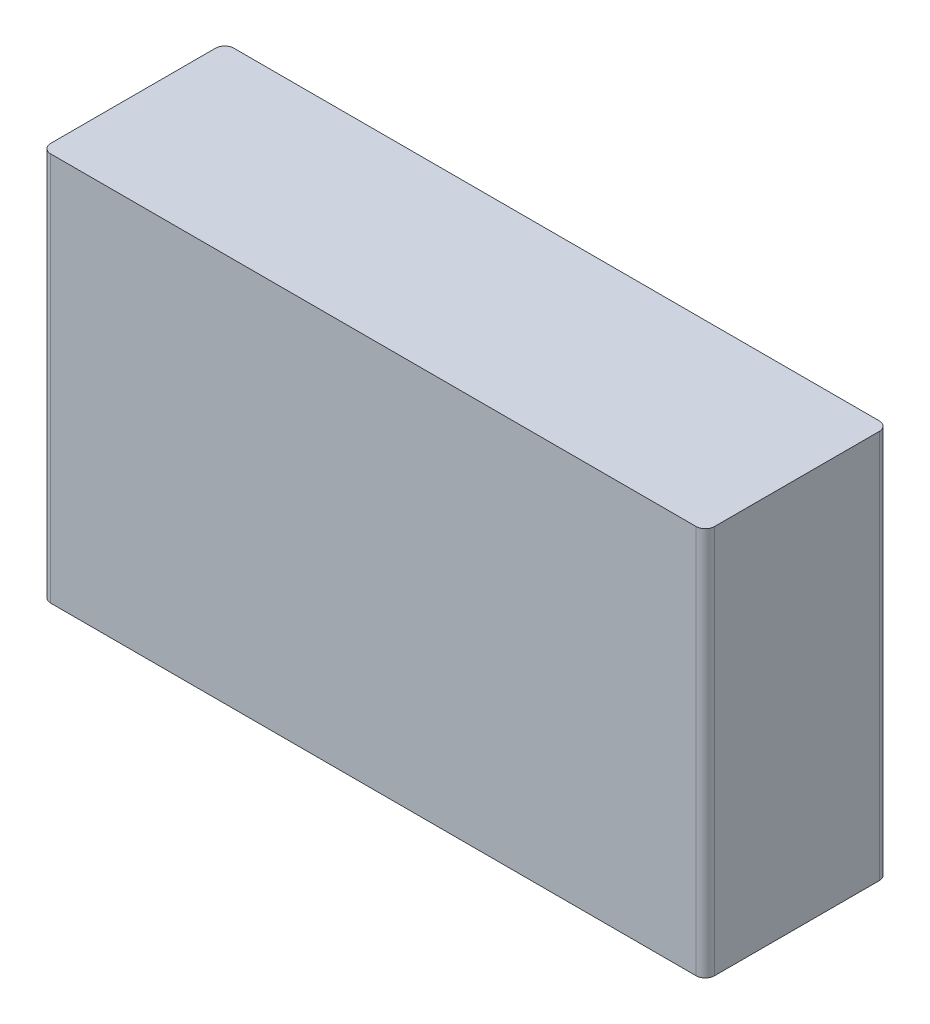
ISO-10303-21;
HEADER;
FILE_DESCRIPTION(('STEP AP214'),'2;1');
FILE_NAME('part.step','',(''),(''),'','','');
FILE_SCHEMA(('AUTOMOTIVE_DESIGN { 1 0 10303 214 1 1 1 1 }'));
ENDSEC;
DATA;
#1=APPLICATION_CONTEXT('core data for automotive mechanical design processes');
#2=APPLICATION_PROTOCOL_DEFINITION('international standard','automotive_design',2000,#1);
#3=PRODUCT_CONTEXT('',#1,'mechanical');
#4=PRODUCT('Part','Part','',(#3));
#5=PRODUCT_RELATED_PRODUCT_CATEGORY('part','',(#4));
#6=PRODUCT_DEFINITION_FORMATION('','',#4);
#7=PRODUCT_DEFINITION_CONTEXT('part definition',#1,'design');
#8=PRODUCT_DEFINITION('design','',#6,#7);
#9=PRODUCT_DEFINITION_SHAPE('','',#8);
#10=(LENGTH_UNIT() NAMED_UNIT(*) SI_UNIT(.MILLI.,.METRE.));
#11=(NAMED_UNIT(*) PLANE_ANGLE_UNIT() SI_UNIT($,.RADIAN.));
#12=(NAMED_UNIT(*) SI_UNIT($,.STERADIAN.) SOLID_ANGLE_UNIT());
#13=UNCERTAINTY_MEASURE_WITH_UNIT(LENGTH_MEASURE(1.E-05),#10,'distance_accuracy_value','');
#14=(GEOMETRIC_REPRESENTATION_CONTEXT(3) GLOBAL_UNCERTAINTY_ASSIGNED_CONTEXT((#13)) GLOBAL_UNIT_ASSIGNED_CONTEXT((#10,
#11,#12)) REPRESENTATION_CONTEXT('',''));
#15=CARTESIAN_POINT('',(0.,0.,0.));
#16=DIRECTION('',(0.,0.,1.));
#17=DIRECTION('',(1.,0.,0.));
#18=AXIS2_PLACEMENT_3D('',#15,#16,#17);
#19=CARTESIAN_POINT('',(0.775,0.425,0.));
#20=DIRECTION('',(0.,1.,0.));
#21=DIRECTION('',(1.,0.,0.));
#22=AXIS2_PLACEMENT_3D('',#19,#20,#21);
#23=PLANE('',#22);
#24=DIRECTION('',(1.,0.,0.));
#25=VECTOR('',#24,1.);
#26=CARTESIAN_POINT('',(0.75,0.425,0.05));
#27=LINE('',#26,#25);
#28=CARTESIAN_POINT('',(-0.705,0.425,0.05));
#29=VERTEX_POINT('',#28);
#30=CARTESIAN_POINT('',(0.705,0.425,0.05));
#31=VERTEX_POINT('',#30);
#32=EDGE_CURVE('E41',#29,#31,#27,.T.);
#33=ORIENTED_EDGE('',*,*,#32,.F.);
#34=CARTESIAN_POINT('',(-0.705,0.425,0.07));
#35=DIRECTION('',(0.,-1.,0.));
#36=DIRECTION('',(-0.707106781186548,0.,-0.707106781186548));
#37=AXIS2_PLACEMENT_3D('',#34,#35,#36);
#38=CIRCLE('',#37,0.02);
#39=CARTESIAN_POINT('',(-0.725,0.425,0.07));
#40=VERTEX_POINT('',#39);
#41=EDGE_CURVE('E165',#40,#29,#38,.T.);
#42=ORIENTED_EDGE('',*,*,#41,.F.);
#43=DIRECTION('',(0.,0.,-1.));
#44=VECTOR('',#43,1.);
#45=CARTESIAN_POINT('',(-0.725,0.425,0.025));
#46=LINE('',#45,#44);
#47=CARTESIAN_POINT('',(-0.725,0.425,0.43));
#48=VERTEX_POINT('',#47);
#49=EDGE_CURVE('E148',#48,#40,#46,.T.);
#50=ORIENTED_EDGE('',*,*,#49,.F.);
#51=CARTESIAN_POINT('',(-0.705,0.425,0.43));
#52=DIRECTION('',(0.,-1.,0.));
#53=DIRECTION('',(-0.707106781186548,0.,0.707106781186548));
#54=AXIS2_PLACEMENT_3D('',#51,#52,#53);
#55=CIRCLE('',#54,0.02);
#56=CARTESIAN_POINT('',(-0.705,0.425,0.45));
#57=VERTEX_POINT('',#56);
#58=EDGE_CURVE('E11',#57,#48,#55,.T.);
#59=ORIENTED_EDGE('',*,*,#58,.F.);
#60=DIRECTION('',(-1.,0.,0.));
#61=VECTOR('',#60,1.);
#62=CARTESIAN_POINT('',(0.025,0.425,0.45));
#63=LINE('',#62,#61);
#64=CARTESIAN_POINT('',(0.705,0.425,0.45));
#65=VERTEX_POINT('',#64);
#66=EDGE_CURVE('E144',#65,#57,#63,.T.);
#67=ORIENTED_EDGE('',*,*,#66,.F.);
#68=CARTESIAN_POINT('',(0.705,0.425,0.43));
#69=DIRECTION('',(0.,-1.,0.));
#70=DIRECTION('',(0.707106781186548,0.,0.707106781186548));
#71=AXIS2_PLACEMENT_3D('',#68,#69,#70);
#72=CIRCLE('',#71,0.02);
#73=CARTESIAN_POINT('',(0.725,0.425,0.43));
#74=VERTEX_POINT('',#73);
#75=EDGE_CURVE('E111',#74,#65,#72,.T.);
#76=ORIENTED_EDGE('',*,*,#75,.F.);
#77=DIRECTION('',(0.,0.,1.));
#78=VECTOR('',#77,1.);
#79=CARTESIAN_POINT('',(0.725,0.425,0.225));
#80=LINE('',#79,#78);
#81=CARTESIAN_POINT('',(0.725,0.425,0.07));
#82=VERTEX_POINT('',#81);
#83=EDGE_CURVE('E106',#82,#74,#80,.T.);
#84=ORIENTED_EDGE('',*,*,#83,.F.);
#85=CARTESIAN_POINT('',(0.705,0.425,0.07));
#86=DIRECTION('',(0.,-1.,0.));
#87=DIRECTION('',(0.707106781186548,0.,-0.707106781186548));
#88=AXIS2_PLACEMENT_3D('',#85,#86,#87);
#89=CIRCLE('',#88,0.02);
#90=EDGE_CURVE('E108',#31,#82,#89,.T.);
#91=ORIENTED_EDGE('',*,*,#90,.F.);
#92=EDGE_LOOP('',(#33,#42,#50,#59,#67,#76,#84,#91));
#93=FACE_BOUND('',#92,.T.);
#94=ADVANCED_FACE('F16',(#93),#23,.T.);
#95=CARTESIAN_POINT('',(-0.705,0.425,0.43));
#96=DIRECTION('',(0.,1.,0.));
#97=DIRECTION('',(-0.707106781186548,0.,0.707106781186548));
#98=AXIS2_PLACEMENT_3D('',#95,#96,#97);
#99=CYLINDRICAL_SURFACE('',#98,0.02);
#100=ORIENTED_EDGE('',*,*,#58,.T.);
#101=DIRECTION('',(0.,-1.,0.));
#102=VECTOR('',#101,1.);
#103=CARTESIAN_POINT('',(-0.725,0.425,0.43));
#104=LINE('',#103,#102);
#105=CARTESIAN_POINT('',(-0.725,-0.425,0.43));
#106=VERTEX_POINT('',#105);
#107=EDGE_CURVE('E27',#48,#106,#104,.T.);
#108=ORIENTED_EDGE('',*,*,#107,.T.);
#109=CARTESIAN_POINT('',(-0.705,-0.425,0.43));
#110=DIRECTION('',(0.,1.,0.));
#111=DIRECTION('',(-0.707106781186548,0.,0.707106781186548));
#112=AXIS2_PLACEMENT_3D('',#109,#110,#111);
#113=CIRCLE('',#112,0.02);
#114=CARTESIAN_POINT('',(-0.705,-0.425,0.45));
#115=VERTEX_POINT('',#114);
#116=EDGE_CURVE('E85',#106,#115,#113,.T.);
#117=ORIENTED_EDGE('',*,*,#116,.T.);
#118=DIRECTION('',(0.,1.,0.));
#119=VECTOR('',#118,1.);
#120=CARTESIAN_POINT('',(-0.705,0.425,0.45));
#121=LINE('',#120,#119);
#122=EDGE_CURVE('E75',#115,#57,#121,.T.);
#123=ORIENTED_EDGE('',*,*,#122,.T.);
#124=EDGE_LOOP('',(#100,#108,#117,#123));
#125=FACE_BOUND('',#124,.T.);
#126=ADVANCED_FACE('F214',(#125),#99,.T.);
#127=CARTESIAN_POINT('',(-0.775,-0.425,0.));
#128=DIRECTION('',(0.,-1.,0.));
#129=DIRECTION('',(0.,0.,-1.));
#130=AXIS2_PLACEMENT_3D('',#127,#128,#129);
#131=PLANE('',#130);
#132=DIRECTION('',(-1.,0.,0.));
#133=VECTOR('',#132,1.);
#134=CARTESIAN_POINT('',(-0.025,-0.425,0.05));
#135=LINE('',#134,#133);
#136=CARTESIAN_POINT('',(0.705,-0.425,0.05));
#137=VERTEX_POINT('',#136);
#138=CARTESIAN_POINT('',(-0.705,-0.425,0.05));
#139=VERTEX_POINT('',#138);
#140=EDGE_CURVE('E137',#137,#139,#135,.T.);
#141=ORIENTED_EDGE('',*,*,#140,.F.);
#142=CARTESIAN_POINT('',(0.705,-0.425,0.07));
#143=DIRECTION('',(0.,1.,0.));
#144=DIRECTION('',(0.707106781186548,0.,-0.707106781186548));
#145=AXIS2_PLACEMENT_3D('',#142,#143,#144);
#146=CIRCLE('',#145,0.02);
#147=CARTESIAN_POINT('',(0.725,-0.425,0.07));
#148=VERTEX_POINT('',#147);
#149=EDGE_CURVE('E149',#148,#137,#146,.T.);
#150=ORIENTED_EDGE('',*,*,#149,.F.);
#151=DIRECTION('',(0.,0.,-1.));
#152=VECTOR('',#151,1.);
#153=CARTESIAN_POINT('',(0.725,-0.425,0.225));
#154=LINE('',#153,#152);
#155=CARTESIAN_POINT('',(0.725,-0.425,0.43));
#156=VERTEX_POINT('',#155);
#157=EDGE_CURVE('E118',#156,#148,#154,.T.);
#158=ORIENTED_EDGE('',*,*,#157,.F.);
#159=CARTESIAN_POINT('',(0.705,-0.425,0.43));
#160=DIRECTION('',(0.,1.,0.));
#161=DIRECTION('',(0.707106781186548,0.,0.707106781186548));
#162=AXIS2_PLACEMENT_3D('',#159,#160,#161);
#163=CIRCLE('',#162,0.02);
#164=CARTESIAN_POINT('',(0.705,-0.425,0.45));
#165=VERTEX_POINT('',#164);
#166=EDGE_CURVE('E186',#165,#156,#163,.T.);
#167=ORIENTED_EDGE('',*,*,#166,.F.);
#168=DIRECTION('',(1.,0.,0.));
#169=VECTOR('',#168,1.);
#170=CARTESIAN_POINT('',(-0.75,-0.425,0.45));
#171=LINE('',#170,#169);
#172=EDGE_CURVE('E141',#115,#165,#171,.T.);
#173=ORIENTED_EDGE('',*,*,#172,.F.);
#174=ORIENTED_EDGE('',*,*,#116,.F.);
#175=DIRECTION('',(0.,0.,1.));
#176=VECTOR('',#175,1.);
#177=CARTESIAN_POINT('',(-0.725,-0.425,0.025));
#178=LINE('',#177,#176);
#179=CARTESIAN_POINT('',(-0.725,-0.425,0.07));
#180=VERTEX_POINT('',#179);
#181=EDGE_CURVE('E178',#180,#106,#178,.T.);
#182=ORIENTED_EDGE('',*,*,#181,.F.);
#183=CARTESIAN_POINT('',(-0.705,-0.425,0.07));
#184=DIRECTION('',(0.,1.,0.));
#185=DIRECTION('',(-0.707106781186548,0.,-0.707106781186548));
#186=AXIS2_PLACEMENT_3D('',#183,#184,#185);
#187=CIRCLE('',#186,0.02);
#188=EDGE_CURVE('E157',#139,#180,#187,.T.);
#189=ORIENTED_EDGE('',*,*,#188,.F.);
#190=EDGE_LOOP('',(#141,#150,#158,#167,#173,#174,#182,#189));
#191=FACE_BOUND('',#190,.T.);
#192=ADVANCED_FACE('F204',(#191),#131,.T.);
#193=CARTESIAN_POINT('',(-0.725,0.425,0.05));
#194=DIRECTION('',(-1.,0.,0.));
#195=DIRECTION('',(0.,1.,0.));
#196=AXIS2_PLACEMENT_3D('',#193,#194,#195);
#197=PLANE('',#196);
#198=ORIENTED_EDGE('',*,*,#107,.F.);
#199=ORIENTED_EDGE('',*,*,#49,.T.);
#200=DIRECTION('',(0.,1.,0.));
#201=VECTOR('',#200,1.);
#202=CARTESIAN_POINT('',(-0.725,0.425,0.07));
#203=LINE('',#202,#201);
#204=EDGE_CURVE('E151',#180,#40,#203,.T.);
#205=ORIENTED_EDGE('',*,*,#204,.F.);
#206=ORIENTED_EDGE('',*,*,#181,.T.);
#207=EDGE_LOOP('',(#198,#199,#205,#206));
#208=FACE_BOUND('',#207,.T.);
#209=ADVANCED_FACE('F210',(#208),#197,.T.);
#210=CARTESIAN_POINT('',(-0.705,0.425,0.07));
#211=DIRECTION('',(0.,1.,0.));
#212=DIRECTION('',(-0.707106781186548,0.,-0.707106781186548));
#213=AXIS2_PLACEMENT_3D('',#210,#211,#212);
#214=CYLINDRICAL_SURFACE('',#213,0.02);
#215=ORIENTED_EDGE('',*,*,#41,.T.);
#216=DIRECTION('',(0.,-1.,0.));
#217=VECTOR('',#216,1.);
#218=CARTESIAN_POINT('',(-0.705,0.425,0.05));
#219=LINE('',#218,#217);
#220=EDGE_CURVE('E162',#29,#139,#219,.T.);
#221=ORIENTED_EDGE('',*,*,#220,.T.);
#222=ORIENTED_EDGE('',*,*,#188,.T.);
#223=ORIENTED_EDGE('',*,*,#204,.T.);
#224=EDGE_LOOP('',(#215,#221,#222,#223));
#225=FACE_BOUND('',#224,.T.);
#226=ADVANCED_FACE('F197',(#225),#214,.T.);
#227=CARTESIAN_POINT('',(0.705,0.425,0.07));
#228=DIRECTION('',(0.,-1.,0.));
#229=DIRECTION('',(0.707106781186548,0.,-0.707106781186548));
#230=AXIS2_PLACEMENT_3D('',#227,#228,#229);
#231=CYLINDRICAL_SURFACE('',#230,0.02);
#232=ORIENTED_EDGE('',*,*,#149,.T.);
#233=DIRECTION('',(0.,1.,0.));
#234=VECTOR('',#233,1.);
#235=CARTESIAN_POINT('',(0.705,0.425,0.05));
#236=LINE('',#235,#234);
#237=EDGE_CURVE('E124',#137,#31,#236,.T.);
#238=ORIENTED_EDGE('',*,*,#237,.T.);
#239=ORIENTED_EDGE('',*,*,#90,.T.);
#240=DIRECTION('',(0.,-1.,0.));
#241=VECTOR('',#240,1.);
#242=CARTESIAN_POINT('',(0.725,0.425,0.07));
#243=LINE('',#242,#241);
#244=EDGE_CURVE('E117',#82,#148,#243,.T.);
#245=ORIENTED_EDGE('',*,*,#244,.T.);
#246=EDGE_LOOP('',(#232,#238,#239,#245));
#247=FACE_BOUND('',#246,.T.);
#248=ADVANCED_FACE('F18',(#247),#231,.T.);
#249=CARTESIAN_POINT('',(0.725,0.425,0.45));
#250=DIRECTION('',(1.,0.,0.));
#251=DIRECTION('',(0.,1.,0.));
#252=AXIS2_PLACEMENT_3D('',#249,#250,#251);
#253=PLANE('',#252);
#254=ORIENTED_EDGE('',*,*,#244,.F.);
#255=ORIENTED_EDGE('',*,*,#83,.T.);
#256=DIRECTION('',(0.,1.,0.));
#257=VECTOR('',#256,1.);
#258=CARTESIAN_POINT('',(0.725,0.425,0.43));
#259=LINE('',#258,#257);
#260=EDGE_CURVE('E20',#156,#74,#259,.T.);
#261=ORIENTED_EDGE('',*,*,#260,.F.);
#262=ORIENTED_EDGE('',*,*,#157,.T.);
#263=EDGE_LOOP('',(#254,#255,#261,#262));
#264=FACE_BOUND('',#263,.T.);
#265=ADVANCED_FACE('F127',(#264),#253,.T.);
#266=CARTESIAN_POINT('',(0.705,0.425,0.43));
#267=DIRECTION('',(0.,1.,0.));
#268=DIRECTION('',(0.707106781186548,0.,0.707106781186548));
#269=AXIS2_PLACEMENT_3D('',#266,#267,#268);
#270=CYLINDRICAL_SURFACE('',#269,0.02);
#271=ORIENTED_EDGE('',*,*,#75,.T.);
#272=DIRECTION('',(0.,-1.,0.));
#273=VECTOR('',#272,1.);
#274=CARTESIAN_POINT('',(0.705,0.425,0.45));
#275=LINE('',#274,#273);
#276=EDGE_CURVE('E169',#65,#165,#275,.T.);
#277=ORIENTED_EDGE('',*,*,#276,.T.);
#278=ORIENTED_EDGE('',*,*,#166,.T.);
#279=ORIENTED_EDGE('',*,*,#260,.T.);
#280=EDGE_LOOP('',(#271,#277,#278,#279));
#281=FACE_BOUND('',#280,.T.);
#282=ADVANCED_FACE('F219',(#281),#270,.T.);
#283=CARTESIAN_POINT('',(-0.725,0.425,0.45));
#284=DIRECTION('',(0.,0.,1.));
#285=DIRECTION('',(1.,0.,0.));
#286=AXIS2_PLACEMENT_3D('',#283,#284,#285);
#287=PLANE('',#286);
#288=ORIENTED_EDGE('',*,*,#122,.F.);
#289=ORIENTED_EDGE('',*,*,#172,.T.);
#290=ORIENTED_EDGE('',*,*,#276,.F.);
#291=ORIENTED_EDGE('',*,*,#66,.T.);
#292=EDGE_LOOP('',(#288,#289,#290,#291));
#293=FACE_BOUND('',#292,.T.);
#294=ADVANCED_FACE('F217',(#293),#287,.T.);
#295=CARTESIAN_POINT('',(0.725,0.425,0.05));
#296=DIRECTION('',(0.,0.,-1.));
#297=DIRECTION('',(0.,-1.,0.));
#298=AXIS2_PLACEMENT_3D('',#295,#296,#297);
#299=PLANE('',#298);
#300=ORIENTED_EDGE('',*,*,#237,.F.);
#301=ORIENTED_EDGE('',*,*,#140,.T.);
#302=ORIENTED_EDGE('',*,*,#220,.F.);
#303=ORIENTED_EDGE('',*,*,#32,.T.);
#304=EDGE_LOOP('',(#300,#301,#302,#303));
#305=FACE_BOUND('',#304,.T.);
#306=ADVANCED_FACE('F201',(#305),#299,.T.);
#307=CLOSED_SHELL('',(#94,#126,#192,#209,#226,#248,#265,#282,#294,#306));
#308=MANIFOLD_SOLID_BREP('B1',#307);
#309=ADVANCED_BREP_SHAPE_REPRESENTATION('',(#18,#308),#14);
#310=SHAPE_DEFINITION_REPRESENTATION(#9,#309);
ENDSEC;
END-ISO-10303-21;
